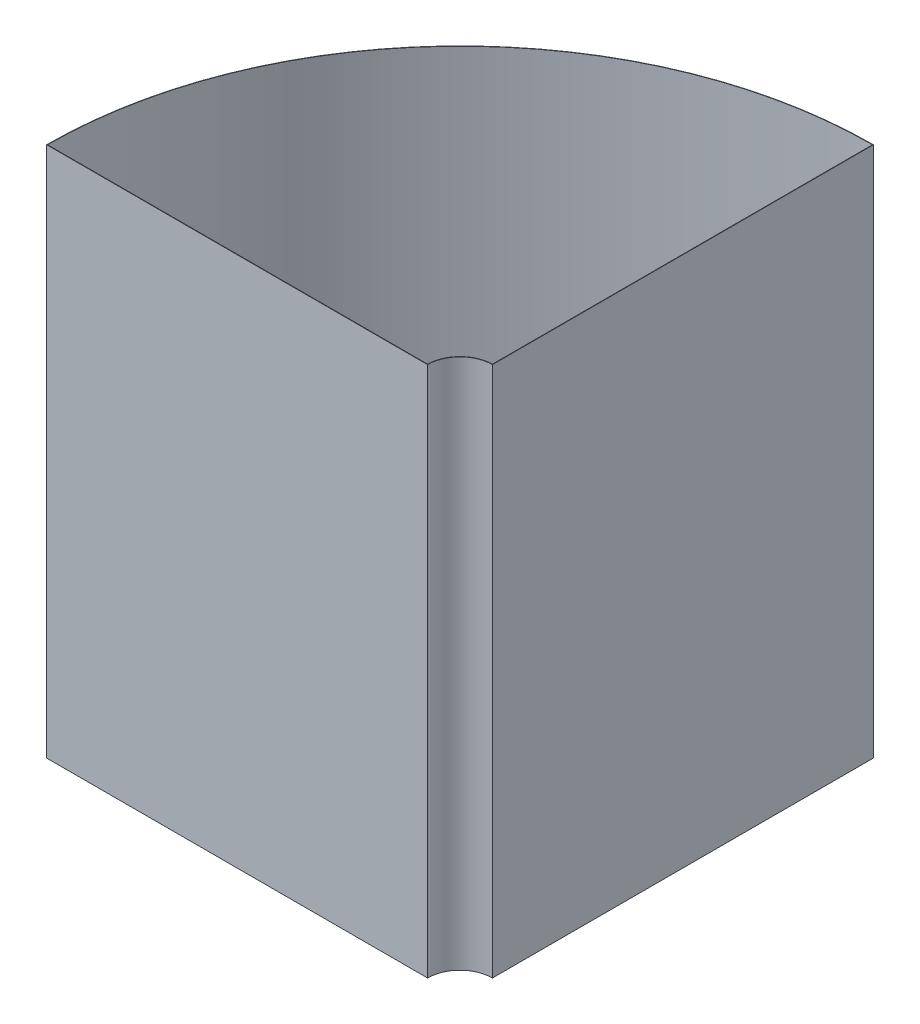
ISO-10303-21;
HEADER;
FILE_DESCRIPTION(('STEP AP214'),'2;1');
FILE_NAME('part.step','',(''),(''),'','','');
FILE_SCHEMA(('AUTOMOTIVE_DESIGN { 1 0 10303 214 1 1 1 1 }'));
ENDSEC;
DATA;
#1=APPLICATION_CONTEXT('core data for automotive mechanical design processes');
#2=APPLICATION_PROTOCOL_DEFINITION('international standard','automotive_design',2000,#1);
#3=PRODUCT_CONTEXT('',#1,'mechanical');
#4=PRODUCT('Part','Part','',(#3));
#5=PRODUCT_RELATED_PRODUCT_CATEGORY('part','',(#4));
#6=PRODUCT_DEFINITION_FORMATION('','',#4);
#7=PRODUCT_DEFINITION_CONTEXT('part definition',#1,'design');
#8=PRODUCT_DEFINITION('design','',#6,#7);
#9=PRODUCT_DEFINITION_SHAPE('','',#8);
#10=(LENGTH_UNIT() NAMED_UNIT(*) SI_UNIT(.MILLI.,.METRE.));
#11=(NAMED_UNIT(*) PLANE_ANGLE_UNIT() SI_UNIT($,.RADIAN.));
#12=(NAMED_UNIT(*) SI_UNIT($,.STERADIAN.) SOLID_ANGLE_UNIT());
#13=UNCERTAINTY_MEASURE_WITH_UNIT(LENGTH_MEASURE(1.E-05),#10,'distance_accuracy_value','');
#14=(GEOMETRIC_REPRESENTATION_CONTEXT(3) GLOBAL_UNCERTAINTY_ASSIGNED_CONTEXT((#13)) GLOBAL_UNIT_ASSIGNED_CONTEXT((#10,
#11,#12)) REPRESENTATION_CONTEXT('',''));
#15=CARTESIAN_POINT('',(0.,0.,0.));
#16=DIRECTION('',(0.,0.,1.));
#17=DIRECTION('',(1.,0.,0.));
#18=AXIS2_PLACEMENT_3D('',#15,#16,#17);
#19=CARTESIAN_POINT('',(0.,450.,0.));
#20=DIRECTION('',(0.,1.,0.));
#21=DIRECTION('',(0.,0.,1.));
#22=AXIS2_PLACEMENT_3D('',#19,#20,#21);
#23=PLANE('',#22);
#24=CARTESIAN_POINT('',(0.,450.,0.));
#25=DIRECTION('',(0.,1.,0.));
#26=DIRECTION('',(0.,0.,1.));
#27=AXIS2_PLACEMENT_3D('',#24,#25,#26);
#28=CIRCLE('',#27,27.5);
#29=CARTESIAN_POINT('',(0.,450.,-27.5));
#30=VERTEX_POINT('',#29);
#31=CARTESIAN_POINT('',(-27.5,450.,0.));
#32=VERTEX_POINT('',#31);
#33=EDGE_CURVE('E167',#30,#32,#28,.T.);
#34=ORIENTED_EDGE('',*,*,#33,.F.);
#35=DIRECTION('',(0.,0.,-1.));
#36=VECTOR('',#35,1.);
#37=CARTESIAN_POINT('',(0.,450.,0.));
#38=LINE('',#37,#36);
#39=CARTESIAN_POINT('',(0.,450.,-350.175));
#40=VERTEX_POINT('',#39);
#41=EDGE_CURVE('E170',#30,#40,#38,.T.);
#42=ORIENTED_EDGE('',*,*,#41,.T.);
#43=CARTESIAN_POINT('',(0.,450.,0.));
#44=DIRECTION('',(0.,1.,0.));
#45=DIRECTION('',(0.,0.,1.));
#46=AXIS2_PLACEMENT_3D('',#43,#44,#45);
#47=CIRCLE('',#46,350.175);
#48=CARTESIAN_POINT('',(-350.175,450.,0.));
#49=VERTEX_POINT('',#48);
#50=EDGE_CURVE('E174',#40,#49,#47,.T.);
#51=ORIENTED_EDGE('',*,*,#50,.T.);
#52=DIRECTION('',(1.,0.,0.));
#53=VECTOR('',#52,1.);
#54=CARTESIAN_POINT('',(0.,450.,0.));
#55=LINE('',#54,#53);
#56=EDGE_CURVE('E68',#49,#32,#55,.T.);
#57=ORIENTED_EDGE('',*,*,#56,.T.);
#58=EDGE_LOOP('',(#34,#42,#51,#57));
#59=FACE_BOUND('',#58,.T.);
#60=DIRECTION('',(0.,0.,-1.));
#61=VECTOR('',#60,1.);
#62=CARTESIAN_POINT('',(-0.35,450.,0.));
#63=LINE('',#62,#61);
#64=CARTESIAN_POINT('',(-0.35,450.,-27.8478006312886));
#65=VERTEX_POINT('',#64);
#66=CARTESIAN_POINT('',(-0.35,450.,-349.824824912412));
#67=VERTEX_POINT('',#66);
#68=EDGE_CURVE('E159',#65,#67,#63,.T.);
#69=ORIENTED_EDGE('',*,*,#68,.F.);
#70=CARTESIAN_POINT('',(0.,450.,0.));
#71=DIRECTION('',(0.,1.,0.));
#72=DIRECTION('',(0.,0.,1.));
#73=AXIS2_PLACEMENT_3D('',#70,#71,#72);
#74=CIRCLE('',#73,27.85);
#75=CARTESIAN_POINT('',(-27.8478006312886,450.,-0.35));
#76=VERTEX_POINT('',#75);
#77=EDGE_CURVE('E123',#65,#76,#74,.T.);
#78=ORIENTED_EDGE('',*,*,#77,.T.);
#79=DIRECTION('',(1.,0.,0.));
#80=VECTOR('',#79,1.);
#81=CARTESIAN_POINT('',(0.,450.,-0.35));
#82=LINE('',#81,#80);
#83=CARTESIAN_POINT('',(-349.824824912412,450.,-0.35));
#84=VERTEX_POINT('',#83);
#85=EDGE_CURVE('E147',#84,#76,#82,.T.);
#86=ORIENTED_EDGE('',*,*,#85,.F.);
#87=CARTESIAN_POINT('',(0.,450.,0.));
#88=DIRECTION('',(0.,1.,0.));
#89=DIRECTION('',(0.,0.,1.));
#90=AXIS2_PLACEMENT_3D('',#87,#88,#89);
#91=CIRCLE('',#90,349.825);
#92=EDGE_CURVE('E162',#67,#84,#91,.T.);
#93=ORIENTED_EDGE('',*,*,#92,.F.);
#94=EDGE_LOOP('',(#69,#78,#86,#93));
#95=FACE_BOUND('',#94,.T.);
#96=ADVANCED_FACE('F43',(#59,#95),#23,.T.);
#97=CARTESIAN_POINT('',(0.,450.,0.));
#98=DIRECTION('',(0.,-1.,0.));
#99=DIRECTION('',(0.,0.,-1.));
#100=AXIS2_PLACEMENT_3D('',#97,#98,#99);
#101=CYLINDRICAL_SURFACE('',#100,27.5);
#102=CARTESIAN_POINT('',(0.,0.,0.));
#103=DIRECTION('',(0.,1.,0.));
#104=DIRECTION('',(0.,0.,1.));
#105=AXIS2_PLACEMENT_3D('',#102,#103,#104);
#106=CIRCLE('',#105,27.5);
#107=CARTESIAN_POINT('',(0.,0.,-27.5));
#108=VERTEX_POINT('',#107);
#109=CARTESIAN_POINT('',(-27.5,0.,0.));
#110=VERTEX_POINT('',#109);
#111=EDGE_CURVE('E127',#108,#110,#106,.T.);
#112=ORIENTED_EDGE('',*,*,#111,.F.);
#113=DIRECTION('',(0.,-1.,0.));
#114=VECTOR('',#113,1.);
#115=CARTESIAN_POINT('',(0.,450.,-27.5));
#116=LINE('',#115,#114);
#117=EDGE_CURVE('E11',#30,#108,#116,.T.);
#118=ORIENTED_EDGE('',*,*,#117,.F.);
#119=ORIENTED_EDGE('',*,*,#33,.T.);
#120=DIRECTION('',(0.,-1.,0.));
#121=VECTOR('',#120,1.);
#122=CARTESIAN_POINT('',(-27.5,450.,0.));
#123=LINE('',#122,#121);
#124=EDGE_CURVE('E88',#32,#110,#123,.T.);
#125=ORIENTED_EDGE('',*,*,#124,.T.);
#126=EDGE_LOOP('',(#112,#118,#119,#125));
#127=FACE_BOUND('',#126,.T.);
#128=ADVANCED_FACE('F45',(#127),#101,.F.);
#129=CARTESIAN_POINT('',(0.,450.,0.));
#130=DIRECTION('',(-1.,0.,0.));
#131=DIRECTION('',(0.,0.,1.));
#132=AXIS2_PLACEMENT_3D('',#129,#130,#131);
#133=PLANE('',#132);
#134=DIRECTION('',(0.,0.,-1.));
#135=VECTOR('',#134,1.);
#136=CARTESIAN_POINT('',(0.,0.,0.));
#137=LINE('',#136,#135);
#138=CARTESIAN_POINT('',(0.,0.,-350.175));
#139=VERTEX_POINT('',#138);
#140=EDGE_CURVE('E182',#108,#139,#137,.T.);
#141=ORIENTED_EDGE('',*,*,#140,.T.);
#142=DIRECTION('',(0.,-1.,0.));
#143=VECTOR('',#142,1.);
#144=CARTESIAN_POINT('',(0.,450.,-350.175));
#145=LINE('',#144,#143);
#146=EDGE_CURVE('E52',#40,#139,#145,.T.);
#147=ORIENTED_EDGE('',*,*,#146,.F.);
#148=ORIENTED_EDGE('',*,*,#41,.F.);
#149=ORIENTED_EDGE('',*,*,#117,.T.);
#150=EDGE_LOOP('',(#141,#147,#148,#149));
#151=FACE_BOUND('',#150,.T.);
#152=ADVANCED_FACE('F211',(#151),#133,.F.);
#153=CARTESIAN_POINT('',(0.,450.,0.));
#154=DIRECTION('',(0.,-1.,0.));
#155=DIRECTION('',(0.,0.,-1.));
#156=AXIS2_PLACEMENT_3D('',#153,#154,#155);
#157=CYLINDRICAL_SURFACE('',#156,350.175);
#158=CARTESIAN_POINT('',(0.,0.,0.));
#159=DIRECTION('',(0.,1.,0.));
#160=DIRECTION('',(0.,0.,1.));
#161=AXIS2_PLACEMENT_3D('',#158,#159,#160);
#162=CIRCLE('',#161,350.175);
#163=CARTESIAN_POINT('',(-350.175,0.,0.));
#164=VERTEX_POINT('',#163);
#165=EDGE_CURVE('E185',#139,#164,#162,.T.);
#166=ORIENTED_EDGE('',*,*,#165,.T.);
#167=DIRECTION('',(0.,-1.,0.));
#168=VECTOR('',#167,1.);
#169=CARTESIAN_POINT('',(-350.175,450.,0.));
#170=LINE('',#169,#168);
#171=EDGE_CURVE('E192',#49,#164,#170,.T.);
#172=ORIENTED_EDGE('',*,*,#171,.F.);
#173=ORIENTED_EDGE('',*,*,#50,.F.);
#174=ORIENTED_EDGE('',*,*,#146,.T.);
#175=EDGE_LOOP('',(#166,#172,#173,#174));
#176=FACE_BOUND('',#175,.T.);
#177=ADVANCED_FACE('F201',(#176),#157,.T.);
#178=CARTESIAN_POINT('',(0.,450.,0.));
#179=DIRECTION('',(0.,0.,-1.));
#180=DIRECTION('',(-1.,0.,0.));
#181=AXIS2_PLACEMENT_3D('',#178,#179,#180);
#182=PLANE('',#181);
#183=DIRECTION('',(1.,0.,0.));
#184=VECTOR('',#183,1.);
#185=CARTESIAN_POINT('',(0.,0.,0.));
#186=LINE('',#185,#184);
#187=EDGE_CURVE('E171',#164,#110,#186,.T.);
#188=ORIENTED_EDGE('',*,*,#187,.T.);
#189=ORIENTED_EDGE('',*,*,#124,.F.);
#190=ORIENTED_EDGE('',*,*,#56,.F.);
#191=ORIENTED_EDGE('',*,*,#171,.T.);
#192=EDGE_LOOP('',(#188,#189,#190,#191));
#193=FACE_BOUND('',#192,.T.);
#194=ADVANCED_FACE('F209',(#193),#182,.F.);
#195=CARTESIAN_POINT('',(0.,0.,0.));
#196=DIRECTION('',(0.,1.,0.));
#197=DIRECTION('',(0.,0.,1.));
#198=AXIS2_PLACEMENT_3D('',#195,#196,#197);
#199=PLANE('',#198);
#200=ORIENTED_EDGE('',*,*,#111,.T.);
#201=ORIENTED_EDGE('',*,*,#187,.F.);
#202=ORIENTED_EDGE('',*,*,#165,.F.);
#203=ORIENTED_EDGE('',*,*,#140,.F.);
#204=EDGE_LOOP('',(#200,#201,#202,#203));
#205=FACE_BOUND('',#204,.T.);
#206=ADVANCED_FACE('F207',(#205),#199,.F.);
#207=CARTESIAN_POINT('',(0.,450.,0.));
#208=DIRECTION('',(0.,-1.,0.));
#209=DIRECTION('',(0.,0.,-1.));
#210=AXIS2_PLACEMENT_3D('',#207,#208,#209);
#211=CYLINDRICAL_SURFACE('',#210,27.85);
#212=CARTESIAN_POINT('',(0.,0.350000000000017,0.));
#213=DIRECTION('',(0.,1.,0.));
#214=DIRECTION('',(0.,0.,1.));
#215=AXIS2_PLACEMENT_3D('',#212,#213,#214);
#216=CIRCLE('',#215,27.85);
#217=CARTESIAN_POINT('',(-0.35,0.35,-27.8478006312886));
#218=VERTEX_POINT('',#217);
#219=CARTESIAN_POINT('',(-27.8478006312886,0.35,-0.35));
#220=VERTEX_POINT('',#219);
#221=EDGE_CURVE('E121',#218,#220,#216,.T.);
#222=ORIENTED_EDGE('',*,*,#221,.T.);
#223=DIRECTION('',(0.,-1.,0.));
#224=VECTOR('',#223,1.);
#225=CARTESIAN_POINT('',(-27.8478006312886,450.,-0.35));
#226=LINE('',#225,#224);
#227=EDGE_CURVE('E145',#76,#220,#226,.T.);
#228=ORIENTED_EDGE('',*,*,#227,.F.);
#229=ORIENTED_EDGE('',*,*,#77,.F.);
#230=DIRECTION('',(0.,-1.,0.));
#231=VECTOR('',#230,1.);
#232=CARTESIAN_POINT('',(-0.35,450.,-27.8478006312886));
#233=LINE('',#232,#231);
#234=EDGE_CURVE('E116',#65,#218,#233,.T.);
#235=ORIENTED_EDGE('',*,*,#234,.T.);
#236=EDGE_LOOP('',(#222,#228,#229,#235));
#237=FACE_BOUND('',#236,.T.);
#238=ADVANCED_FACE('F118',(#237),#211,.T.);
#239=CARTESIAN_POINT('',(-0.35,450.,0.));
#240=DIRECTION('',(-1.,0.,0.));
#241=DIRECTION('',(0.,0.,1.));
#242=AXIS2_PLACEMENT_3D('',#239,#240,#241);
#243=PLANE('',#242);
#244=DIRECTION('',(0.,0.,-1.));
#245=VECTOR('',#244,1.);
#246=CARTESIAN_POINT('',(-0.35,0.350000000000017,0.));
#247=LINE('',#246,#245);
#248=CARTESIAN_POINT('',(-0.35,0.35,-349.824824912412));
#249=VERTEX_POINT('',#248);
#250=EDGE_CURVE('E131',#218,#249,#247,.T.);
#251=ORIENTED_EDGE('',*,*,#250,.F.);
#252=ORIENTED_EDGE('',*,*,#234,.F.);
#253=ORIENTED_EDGE('',*,*,#68,.T.);
#254=DIRECTION('',(0.,-1.,0.));
#255=VECTOR('',#254,1.);
#256=CARTESIAN_POINT('',(-0.35,450.,-349.824824912412));
#257=LINE('',#256,#255);
#258=EDGE_CURVE('E128',#67,#249,#257,.T.);
#259=ORIENTED_EDGE('',*,*,#258,.T.);
#260=EDGE_LOOP('',(#251,#252,#253,#259));
#261=FACE_BOUND('',#260,.T.);
#262=ADVANCED_FACE('F132',(#261),#243,.T.);
#263=CARTESIAN_POINT('',(0.,450.,0.));
#264=DIRECTION('',(0.,-1.,0.));
#265=DIRECTION('',(0.,0.,-1.));
#266=AXIS2_PLACEMENT_3D('',#263,#264,#265);
#267=CYLINDRICAL_SURFACE('',#266,349.825);
#268=CARTESIAN_POINT('',(0.,0.350000000000017,0.));
#269=DIRECTION('',(0.,1.,0.));
#270=DIRECTION('',(0.,0.,1.));
#271=AXIS2_PLACEMENT_3D('',#268,#269,#270);
#272=CIRCLE('',#271,349.825);
#273=CARTESIAN_POINT('',(-349.824824912412,0.35,-0.35));
#274=VERTEX_POINT('',#273);
#275=EDGE_CURVE('E137',#249,#274,#272,.T.);
#276=ORIENTED_EDGE('',*,*,#275,.F.);
#277=ORIENTED_EDGE('',*,*,#258,.F.);
#278=ORIENTED_EDGE('',*,*,#92,.T.);
#279=DIRECTION('',(0.,-1.,0.));
#280=VECTOR('',#279,1.);
#281=CARTESIAN_POINT('',(-349.824824912412,450.,-0.35));
#282=LINE('',#281,#280);
#283=EDGE_CURVE('E59',#84,#274,#282,.T.);
#284=ORIENTED_EDGE('',*,*,#283,.T.);
#285=EDGE_LOOP('',(#276,#277,#278,#284));
#286=FACE_BOUND('',#285,.T.);
#287=ADVANCED_FACE('F250',(#286),#267,.F.);
#288=CARTESIAN_POINT('',(0.,450.,-0.35));
#289=DIRECTION('',(0.,0.,-1.));
#290=DIRECTION('',(-1.,0.,0.));
#291=AXIS2_PLACEMENT_3D('',#288,#289,#290);
#292=PLANE('',#291);
#293=DIRECTION('',(1.,0.,0.));
#294=VECTOR('',#293,1.);
#295=CARTESIAN_POINT('',(0.,0.350000000000017,-0.35));
#296=LINE('',#295,#294);
#297=EDGE_CURVE('E141',#274,#220,#296,.T.);
#298=ORIENTED_EDGE('',*,*,#297,.F.);
#299=ORIENTED_EDGE('',*,*,#283,.F.);
#300=ORIENTED_EDGE('',*,*,#85,.T.);
#301=ORIENTED_EDGE('',*,*,#227,.T.);
#302=EDGE_LOOP('',(#298,#299,#300,#301));
#303=FACE_BOUND('',#302,.T.);
#304=ADVANCED_FACE('F257',(#303),#292,.T.);
#305=CARTESIAN_POINT('',(0.,0.35,0.));
#306=DIRECTION('',(0.,1.,0.));
#307=DIRECTION('',(0.,0.,1.));
#308=AXIS2_PLACEMENT_3D('',#305,#306,#307);
#309=PLANE('',#308);
#310=ORIENTED_EDGE('',*,*,#221,.F.);
#311=ORIENTED_EDGE('',*,*,#250,.T.);
#312=ORIENTED_EDGE('',*,*,#275,.T.);
#313=ORIENTED_EDGE('',*,*,#297,.T.);
#314=EDGE_LOOP('',(#310,#311,#312,#313));
#315=FACE_BOUND('',#314,.T.);
#316=ADVANCED_FACE('F140',(#315),#309,.T.);
#317=CLOSED_SHELL('',(#96,#128,#152,#177,#194,#206,#238,#262,#287,#304,#316));
#318=MANIFOLD_SOLID_BREP('B2',#317);
#319=ADVANCED_BREP_SHAPE_REPRESENTATION('',(#18,#318),#14);
#320=SHAPE_DEFINITION_REPRESENTATION(#9,#319);
ENDSEC;
END-ISO-10303-21;
